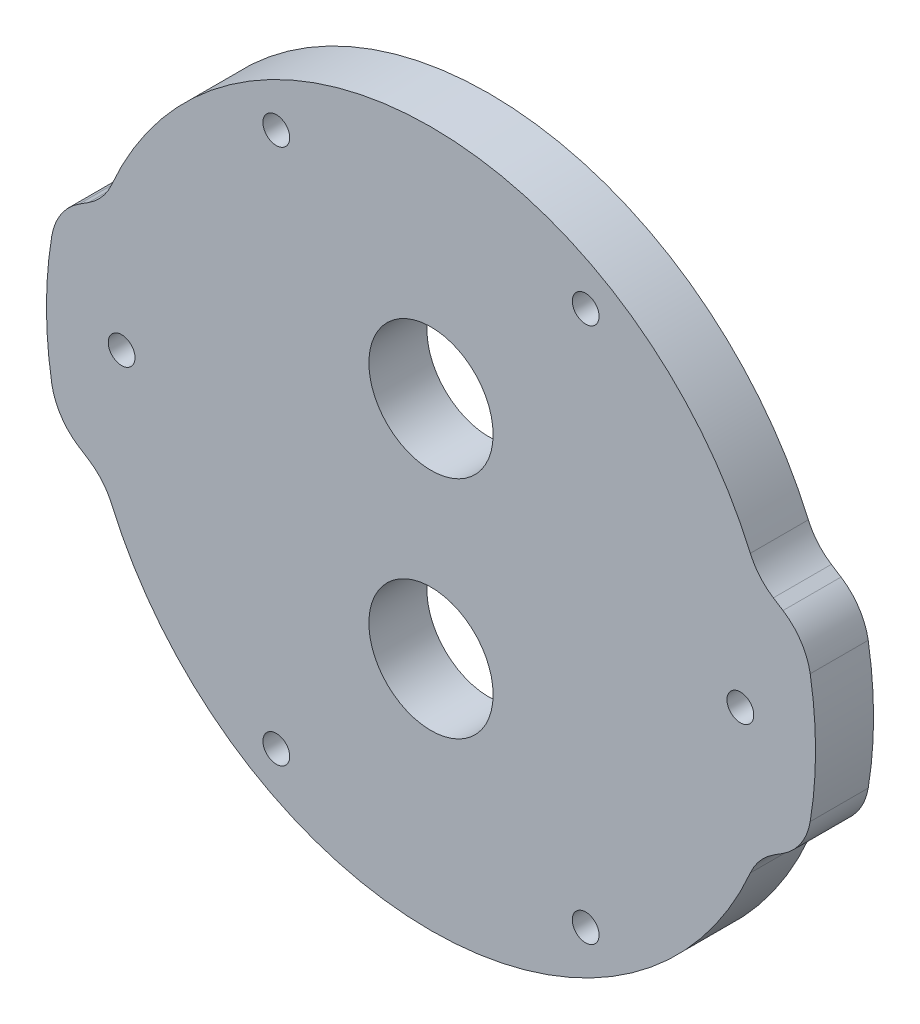
ISO-10303-21;
HEADER;
FILE_DESCRIPTION(('STEP AP214'),'2;1');
FILE_NAME('part.step','',(''),(''),'','','');
FILE_SCHEMA(('AUTOMOTIVE_DESIGN { 1 0 10303 214 1 1 1 1 }'));
ENDSEC;
DATA;
#1=APPLICATION_CONTEXT('core data for automotive mechanical design processes');
#2=APPLICATION_PROTOCOL_DEFINITION('international standard','automotive_design',2000,#1);
#3=PRODUCT_CONTEXT('',#1,'mechanical');
#4=PRODUCT('Part','Part','',(#3));
#5=PRODUCT_RELATED_PRODUCT_CATEGORY('part','',(#4));
#6=PRODUCT_DEFINITION_FORMATION('','',#4);
#7=PRODUCT_DEFINITION_CONTEXT('part definition',#1,'design');
#8=PRODUCT_DEFINITION('design','',#6,#7);
#9=PRODUCT_DEFINITION_SHAPE('','',#8);
#10=(LENGTH_UNIT() NAMED_UNIT(*) SI_UNIT(.MILLI.,.METRE.));
#11=(NAMED_UNIT(*) PLANE_ANGLE_UNIT() SI_UNIT($,.RADIAN.));
#12=(NAMED_UNIT(*) SI_UNIT($,.STERADIAN.) SOLID_ANGLE_UNIT());
#13=UNCERTAINTY_MEASURE_WITH_UNIT(LENGTH_MEASURE(1.E-05),#10,'distance_accuracy_value','');
#14=(GEOMETRIC_REPRESENTATION_CONTEXT(3) GLOBAL_UNCERTAINTY_ASSIGNED_CONTEXT((#13)) GLOBAL_UNIT_ASSIGNED_CONTEXT((#10,
#11,#12)) REPRESENTATION_CONTEXT('',''));
#15=CARTESIAN_POINT('',(0.,0.,0.));
#16=DIRECTION('',(0.,0.,1.));
#17=DIRECTION('',(1.,0.,0.));
#18=AXIS2_PLACEMENT_3D('',#15,#16,#17);
#19=CARTESIAN_POINT('',(0.,0.,4.7625));
#20=DIRECTION('',(0.,0.,-1.));
#21=DIRECTION('',(-1.,0.,0.));
#22=AXIS2_PLACEMENT_3D('',#19,#20,#21);
#23=PLANE('',#22);
#24=CARTESIAN_POINT('',(0.,9.25,4.7625));
#25=DIRECTION('',(0.,0.,1.));
#26=DIRECTION('',(1.,0.,0.));
#27=AXIS2_PLACEMENT_3D('',#24,#25,#26);
#28=CIRCLE('',#27,5.1);
#29=CARTESIAN_POINT('',(5.09999999999997,9.25,4.7625));
#30=VERTEX_POINT('',#29);
#31=EDGE_CURVE('E569',#30,#30,#28,.T.);
#32=ORIENTED_EDGE('',*,*,#31,.F.);
#33=EDGE_LOOP('',(#32));
#34=FACE_BOUND('',#33,.T.);
#35=CARTESIAN_POINT('',(0.,-9.25,4.7625));
#36=DIRECTION('',(0.,0.,1.));
#37=DIRECTION('',(1.,0.,0.));
#38=AXIS2_PLACEMENT_3D('',#35,#36,#37);
#39=CIRCLE('',#38,5.1);
#40=CARTESIAN_POINT('',(5.10000000000004,-9.25,4.7625));
#41=VERTEX_POINT('',#40);
#42=EDGE_CURVE('E571',#41,#41,#39,.T.);
#43=ORIENTED_EDGE('',*,*,#42,.F.);
#44=EDGE_LOOP('',(#43));
#45=FACE_BOUND('',#44,.T.);
#46=CARTESIAN_POINT('',(25.4000000000023,0.,4.7625));
#47=DIRECTION('',(0.,0.,1.));
#48=DIRECTION('',(1.,0.,0.));
#49=AXIS2_PLACEMENT_3D('',#46,#47,#48);
#50=CIRCLE('',#49,1.10000000000001);
#51=CARTESIAN_POINT('',(26.5000000000024,0.,4.7625));
#52=VERTEX_POINT('',#51);
#53=EDGE_CURVE('E586',#52,#52,#50,.T.);
#54=ORIENTED_EDGE('',*,*,#53,.F.);
#55=EDGE_LOOP('',(#54));
#56=FACE_BOUND('',#55,.T.);
#57=CARTESIAN_POINT('',(-12.7000000000012,21.9970452561268,4.7625));
#58=DIRECTION('',(0.,0.,1.));
#59=DIRECTION('',(1.,0.,0.));
#60=AXIS2_PLACEMENT_3D('',#57,#58,#59);
#61=CIRCLE('',#60,1.1);
#62=CARTESIAN_POINT('',(-11.6000000000012,21.9970452561268,4.7625));
#63=VERTEX_POINT('',#62);
#64=EDGE_CURVE('E598',#63,#63,#61,.T.);
#65=ORIENTED_EDGE('',*,*,#64,.F.);
#66=EDGE_LOOP('',(#65));
#67=FACE_BOUND('',#66,.T.);
#68=CARTESIAN_POINT('',(-25.4000000000023,0.,4.7625));
#69=DIRECTION('',(0.,0.,1.));
#70=DIRECTION('',(1.,0.,0.));
#71=AXIS2_PLACEMENT_3D('',#68,#69,#70);
#72=CIRCLE('',#71,1.1);
#73=CARTESIAN_POINT('',(-24.3000000000023,0.,4.7625));
#74=VERTEX_POINT('',#73);
#75=EDGE_CURVE('E306',#74,#74,#72,.T.);
#76=ORIENTED_EDGE('',*,*,#75,.F.);
#77=EDGE_LOOP('',(#76));
#78=FACE_BOUND('',#77,.T.);
#79=CARTESIAN_POINT('',(0.,0.,4.7625));
#80=DIRECTION('',(0.,0.,1.));
#81=DIRECTION('',(-1.,0.,0.));
#82=AXIS2_PLACEMENT_3D('',#79,#80,#81);
#83=CIRCLE('',#82,31.575);
#84=CARTESIAN_POINT('',(31.1345138238998,-5.25572772785986,4.7625));
#85=VERTEX_POINT('',#84);
#86=CARTESIAN_POINT('',(31.1345138238998,5.25572772785986,4.7625));
#87=VERTEX_POINT('',#86);
#88=EDGE_CURVE('E195',#85,#87,#83,.T.);
#89=ORIENTED_EDGE('',*,*,#88,.T.);
#90=CARTESIAN_POINT('',(26.2042661874944,4.42346680500003,4.7625));
#91=DIRECTION('',(0.,0.,-1.));
#92=DIRECTION('',(-1.,0.,0.));
#93=AXIS2_PLACEMENT_3D('',#90,#91,#92);
#94=CIRCLE('',#93,5.);
#95=CARTESIAN_POINT('',(28.9010073987016,8.63388089862277,4.7625));
#96=VERTEX_POINT('',#95);
#97=EDGE_CURVE('E220',#87,#96,#94,.F.);
#98=ORIENTED_EDGE('',*,*,#97,.T.);
#99=DIRECTION('',(-0.842082818724548,0.53934824224143,0.));
#100=VECTOR('',#99,1.);
#101=CARTESIAN_POINT('',(30.6713322990704,7.50000000000001,4.7625));
#102=LINE('',#101,#100);
#103=CARTESIAN_POINT('',(28.1095056204985,9.14083233298568,4.7625));
#104=VERTEX_POINT('',#103);
#105=EDGE_CURVE('E297',#96,#104,#102,.T.);
#106=ORIENTED_EDGE('',*,*,#105,.T.);
#107=CARTESIAN_POINT('',(30.8062468317057,13.3512464266084,4.7625));
#108=DIRECTION('',(0.,0.,-1.));
#109=DIRECTION('',(-1.,0.,0.));
#110=AXIS2_PLACEMENT_3D('',#107,#108,#109);
#111=CIRCLE('',#110,5.);
#112=CARTESIAN_POINT('',(26.2185704606401,11.3629744345595,4.7625));
#113=VERTEX_POINT('',#112);
#114=EDGE_CURVE('E158',#104,#113,#111,.T.);
#115=ORIENTED_EDGE('',*,*,#114,.T.);
#116=CARTESIAN_POINT('',(0.,0.,4.7625));
#117=DIRECTION('',(0.,0.,1.));
#118=DIRECTION('',(1.,0.,0.));
#119=AXIS2_PLACEMENT_3D('',#116,#117,#118);
#120=CIRCLE('',#119,28.575);
#121=CARTESIAN_POINT('',(-26.2185704606401,11.3629744345595,4.7625));
#122=VERTEX_POINT('',#121);
#123=EDGE_CURVE('E168',#113,#122,#120,.T.);
#124=ORIENTED_EDGE('',*,*,#123,.T.);
#125=CARTESIAN_POINT('',(-30.8062468317057,13.3512464266084,4.7625));
#126=DIRECTION('',(0.,0.,-1.));
#127=DIRECTION('',(-1.,0.,0.));
#128=AXIS2_PLACEMENT_3D('',#125,#126,#127);
#129=CIRCLE('',#128,5.);
#130=CARTESIAN_POINT('',(-28.1095056204985,9.14083233298567,4.7625));
#131=VERTEX_POINT('',#130);
#132=EDGE_CURVE('E11',#122,#131,#129,.T.);
#133=ORIENTED_EDGE('',*,*,#132,.T.);
#134=DIRECTION('',(-0.842082818724547,-0.539348242241431,0.));
#135=VECTOR('',#134,1.);
#136=CARTESIAN_POINT('',(-30.6713322990704,7.5,4.7625));
#137=LINE('',#136,#135);
#138=CARTESIAN_POINT('',(-28.9010073987016,8.63388089862276,4.7625));
#139=VERTEX_POINT('',#138);
#140=EDGE_CURVE('E292',#131,#139,#137,.T.);
#141=ORIENTED_EDGE('',*,*,#140,.T.);
#142=CARTESIAN_POINT('',(-26.2042661874944,4.42346680500002,4.7625));
#143=DIRECTION('',(0.,0.,-1.));
#144=DIRECTION('',(-1.,0.,0.));
#145=AXIS2_PLACEMENT_3D('',#142,#143,#144);
#146=CIRCLE('',#145,5.);
#147=CARTESIAN_POINT('',(-31.1345138238998,5.25572772785986,4.7625));
#148=VERTEX_POINT('',#147);
#149=EDGE_CURVE('E214',#139,#148,#146,.F.);
#150=ORIENTED_EDGE('',*,*,#149,.T.);
#151=CARTESIAN_POINT('',(0.,0.,4.7625));
#152=DIRECTION('',(0.,0.,1.));
#153=DIRECTION('',(1.,0.,0.));
#154=AXIS2_PLACEMENT_3D('',#151,#152,#153);
#155=CIRCLE('',#154,31.575);
#156=CARTESIAN_POINT('',(-31.1345138238998,-5.25572772785986,4.7625));
#157=VERTEX_POINT('',#156);
#158=EDGE_CURVE('E283',#148,#157,#155,.T.);
#159=ORIENTED_EDGE('',*,*,#158,.T.);
#160=CARTESIAN_POINT('',(-26.2042661874944,-4.42346680500002,4.7625));
#161=DIRECTION('',(0.,0.,-1.));
#162=DIRECTION('',(-1.,0.,0.));
#163=AXIS2_PLACEMENT_3D('',#160,#161,#162);
#164=CIRCLE('',#163,5.);
#165=CARTESIAN_POINT('',(-28.9010073987016,-8.63388089862276,4.7625));
#166=VERTEX_POINT('',#165);
#167=EDGE_CURVE('E216',#157,#166,#164,.F.);
#168=ORIENTED_EDGE('',*,*,#167,.T.);
#169=DIRECTION('',(0.842082818724547,-0.539348242241431,0.));
#170=VECTOR('',#169,1.);
#171=CARTESIAN_POINT('',(-30.6713322990704,-7.5,4.7625));
#172=LINE('',#171,#170);
#173=CARTESIAN_POINT('',(-28.1095056204985,-9.14083233298567,4.7625));
#174=VERTEX_POINT('',#173);
#175=EDGE_CURVE('E259',#166,#174,#172,.T.);
#176=ORIENTED_EDGE('',*,*,#175,.T.);
#177=CARTESIAN_POINT('',(-30.8062468317057,-13.3512464266084,4.7625));
#178=DIRECTION('',(0.,0.,-1.));
#179=DIRECTION('',(-1.,0.,0.));
#180=AXIS2_PLACEMENT_3D('',#177,#178,#179);
#181=CIRCLE('',#180,5.);
#182=CARTESIAN_POINT('',(-26.2185704606401,-11.3629744345595,4.7625));
#183=VERTEX_POINT('',#182);
#184=EDGE_CURVE('E251',#174,#183,#181,.T.);
#185=ORIENTED_EDGE('',*,*,#184,.T.);
#186=CARTESIAN_POINT('',(0.,0.,4.7625));
#187=DIRECTION('',(0.,0.,1.));
#188=DIRECTION('',(1.,0.,0.));
#189=AXIS2_PLACEMENT_3D('',#186,#187,#188);
#190=CIRCLE('',#189,28.575);
#191=CARTESIAN_POINT('',(26.2185704606401,-11.3629744345595,4.7625));
#192=VERTEX_POINT('',#191);
#193=EDGE_CURVE('E257',#183,#192,#190,.T.);
#194=ORIENTED_EDGE('',*,*,#193,.T.);
#195=CARTESIAN_POINT('',(30.8062468317057,-13.3512464266084,4.7625));
#196=DIRECTION('',(0.,0.,-1.));
#197=DIRECTION('',(-1.,0.,0.));
#198=AXIS2_PLACEMENT_3D('',#195,#196,#197);
#199=CIRCLE('',#198,5.);
#200=CARTESIAN_POINT('',(28.1095056204985,-9.14083233298568,4.7625));
#201=VERTEX_POINT('',#200);
#202=EDGE_CURVE('E56',#192,#201,#199,.T.);
#203=ORIENTED_EDGE('',*,*,#202,.T.);
#204=DIRECTION('',(0.842082818724548,0.53934824224143,0.));
#205=VECTOR('',#204,1.);
#206=CARTESIAN_POINT('',(30.6713322990704,-7.50000000000001,4.7625));
#207=LINE('',#206,#205);
#208=CARTESIAN_POINT('',(28.9010073987016,-8.63388089862277,4.7625));
#209=VERTEX_POINT('',#208);
#210=EDGE_CURVE('E196',#201,#209,#207,.T.);
#211=ORIENTED_EDGE('',*,*,#210,.T.);
#212=CARTESIAN_POINT('',(26.2042661874944,-4.42346680500003,4.7625));
#213=DIRECTION('',(0.,0.,-1.));
#214=DIRECTION('',(-1.,0.,0.));
#215=AXIS2_PLACEMENT_3D('',#212,#213,#214);
#216=CIRCLE('',#215,5.);
#217=EDGE_CURVE('E218',#209,#85,#216,.F.);
#218=ORIENTED_EDGE('',*,*,#217,.T.);
#219=EDGE_LOOP('',(#89,#98,#106,#115,#124,#133,#141,#150,#159,#168,#176,#185,#194,#203,#211,#218));
#220=FACE_BOUND('',#219,.T.);
#221=CARTESIAN_POINT('',(12.7000000000012,-21.9970452561268,4.7625));
#222=DIRECTION('',(0.,0.,1.));
#223=DIRECTION('',(1.,0.,0.));
#224=AXIS2_PLACEMENT_3D('',#221,#222,#223);
#225=CIRCLE('',#224,1.1);
#226=CARTESIAN_POINT('',(13.8000000000012,-21.9970452561268,4.7625));
#227=VERTEX_POINT('',#226);
#228=EDGE_CURVE('E316',#227,#227,#225,.T.);
#229=ORIENTED_EDGE('',*,*,#228,.F.);
#230=EDGE_LOOP('',(#229));
#231=FACE_BOUND('',#230,.T.);
#232=CARTESIAN_POINT('',(12.7000000000012,21.9970452561268,4.7625));
#233=DIRECTION('',(0.,0.,1.));
#234=DIRECTION('',(1.,0.,0.));
#235=AXIS2_PLACEMENT_3D('',#232,#233,#234);
#236=CIRCLE('',#235,1.1);
#237=CARTESIAN_POINT('',(13.8000000000012,21.9970452561268,4.7625));
#238=VERTEX_POINT('',#237);
#239=EDGE_CURVE('E592',#238,#238,#236,.T.);
#240=ORIENTED_EDGE('',*,*,#239,.F.);
#241=EDGE_LOOP('',(#240));
#242=FACE_BOUND('',#241,.T.);
#243=CARTESIAN_POINT('',(-12.7000000000012,-21.9970452561268,4.7625));
#244=DIRECTION('',(0.,0.,1.));
#245=DIRECTION('',(1.,0.,0.));
#246=AXIS2_PLACEMENT_3D('',#243,#244,#245);
#247=CIRCLE('',#246,1.1);
#248=CARTESIAN_POINT('',(-11.6000000000012,-21.9970452561268,4.7625));
#249=VERTEX_POINT('',#248);
#250=EDGE_CURVE('E580',#249,#249,#247,.T.);
#251=ORIENTED_EDGE('',*,*,#250,.F.);
#252=EDGE_LOOP('',(#251));
#253=FACE_BOUND('',#252,.T.);
#254=ADVANCED_FACE('F34',(#34,#45,#56,#67,#78,#220,#231,#242,#253),#23,.F.);
#255=CARTESIAN_POINT('',(0.,0.,0.));
#256=DIRECTION('',(0.,0.,-1.));
#257=DIRECTION('',(-1.,0.,0.));
#258=AXIS2_PLACEMENT_3D('',#255,#256,#257);
#259=PLANE('',#258);
#260=CARTESIAN_POINT('',(0.,9.25,0.));
#261=DIRECTION('',(0.,0.,1.));
#262=DIRECTION('',(1.,0.,0.));
#263=AXIS2_PLACEMENT_3D('',#260,#261,#262);
#264=CIRCLE('',#263,5.1);
#265=CARTESIAN_POINT('',(5.09999999999997,9.25,0.));
#266=VERTEX_POINT('',#265);
#267=EDGE_CURVE('E567',#266,#266,#264,.T.);
#268=ORIENTED_EDGE('',*,*,#267,.T.);
#269=EDGE_LOOP('',(#268));
#270=FACE_BOUND('',#269,.T.);
#271=CARTESIAN_POINT('',(0.,-9.25,0.));
#272=DIRECTION('',(0.,0.,1.));
#273=DIRECTION('',(1.,0.,0.));
#274=AXIS2_PLACEMENT_3D('',#271,#272,#273);
#275=CIRCLE('',#274,5.1);
#276=CARTESIAN_POINT('',(5.10000000000004,-9.25,0.));
#277=VERTEX_POINT('',#276);
#278=EDGE_CURVE('E574',#277,#277,#275,.T.);
#279=ORIENTED_EDGE('',*,*,#278,.T.);
#280=EDGE_LOOP('',(#279));
#281=FACE_BOUND('',#280,.T.);
#282=CARTESIAN_POINT('',(25.4000000000023,0.,0.));
#283=DIRECTION('',(0.,0.,1.));
#284=DIRECTION('',(1.,0.,0.));
#285=AXIS2_PLACEMENT_3D('',#282,#283,#284);
#286=CIRCLE('',#285,1.10000000000001);
#287=CARTESIAN_POINT('',(26.5000000000024,0.,0.));
#288=VERTEX_POINT('',#287);
#289=EDGE_CURVE('E583',#288,#288,#286,.T.);
#290=ORIENTED_EDGE('',*,*,#289,.T.);
#291=EDGE_LOOP('',(#290));
#292=FACE_BOUND('',#291,.T.);
#293=CARTESIAN_POINT('',(-12.7000000000012,21.9970452561268,0.));
#294=DIRECTION('',(0.,0.,1.));
#295=DIRECTION('',(1.,0.,0.));
#296=AXIS2_PLACEMENT_3D('',#293,#294,#295);
#297=CIRCLE('',#296,1.1);
#298=CARTESIAN_POINT('',(-11.6000000000012,21.9970452561268,0.));
#299=VERTEX_POINT('',#298);
#300=EDGE_CURVE('E595',#299,#299,#297,.T.);
#301=ORIENTED_EDGE('',*,*,#300,.T.);
#302=EDGE_LOOP('',(#301));
#303=FACE_BOUND('',#302,.T.);
#304=CARTESIAN_POINT('',(-25.4000000000023,0.,0.));
#305=DIRECTION('',(0.,0.,1.));
#306=DIRECTION('',(1.,0.,0.));
#307=AXIS2_PLACEMENT_3D('',#304,#305,#306);
#308=CIRCLE('',#307,1.1);
#309=CARTESIAN_POINT('',(-24.3000000000023,0.,0.));
#310=VERTEX_POINT('',#309);
#311=EDGE_CURVE('E311',#310,#310,#308,.T.);
#312=ORIENTED_EDGE('',*,*,#311,.T.);
#313=EDGE_LOOP('',(#312));
#314=FACE_BOUND('',#313,.T.);
#315=DIRECTION('',(-0.842082818724548,0.53934824224143,0.));
#316=VECTOR('',#315,1.);
#317=CARTESIAN_POINT('',(30.6713322990704,7.50000000000001,0.));
#318=LINE('',#317,#316);
#319=CARTESIAN_POINT('',(28.9010073987016,8.63388089862277,0.));
#320=VERTEX_POINT('',#319);
#321=CARTESIAN_POINT('',(28.1095056204985,9.14083233298568,0.));
#322=VERTEX_POINT('',#321);
#323=EDGE_CURVE('E176',#320,#322,#318,.T.);
#324=ORIENTED_EDGE('',*,*,#323,.F.);
#325=CARTESIAN_POINT('',(26.2042661874944,4.42346680500003,0.));
#326=DIRECTION('',(0.,0.,-1.));
#327=DIRECTION('',(-1.,0.,0.));
#328=AXIS2_PLACEMENT_3D('',#325,#326,#327);
#329=CIRCLE('',#328,5.);
#330=CARTESIAN_POINT('',(31.1345138238998,5.25572772785986,0.));
#331=VERTEX_POINT('',#330);
#332=EDGE_CURVE('E207',#320,#331,#329,.T.);
#333=ORIENTED_EDGE('',*,*,#332,.T.);
#334=CARTESIAN_POINT('',(0.,0.,0.));
#335=DIRECTION('',(0.,0.,1.));
#336=DIRECTION('',(-1.,0.,0.));
#337=AXIS2_PLACEMENT_3D('',#334,#335,#336);
#338=CIRCLE('',#337,31.575);
#339=CARTESIAN_POINT('',(31.1345138238998,-5.25572772785986,0.));
#340=VERTEX_POINT('',#339);
#341=EDGE_CURVE('E181',#340,#331,#338,.T.);
#342=ORIENTED_EDGE('',*,*,#341,.F.);
#343=CARTESIAN_POINT('',(26.2042661874944,-4.42346680500003,0.));
#344=DIRECTION('',(0.,0.,-1.));
#345=DIRECTION('',(-1.,0.,0.));
#346=AXIS2_PLACEMENT_3D('',#343,#344,#345);
#347=CIRCLE('',#346,5.);
#348=CARTESIAN_POINT('',(28.9010073987016,-8.63388089862277,0.));
#349=VERTEX_POINT('',#348);
#350=EDGE_CURVE('E205',#340,#349,#347,.T.);
#351=ORIENTED_EDGE('',*,*,#350,.T.);
#352=DIRECTION('',(0.842082818724548,0.53934824224143,0.));
#353=VECTOR('',#352,1.);
#354=CARTESIAN_POINT('',(30.6713322990704,-7.50000000000001,0.));
#355=LINE('',#354,#353);
#356=CARTESIAN_POINT('',(28.1095056204985,-9.14083233298568,0.));
#357=VERTEX_POINT('',#356);
#358=EDGE_CURVE('E193',#357,#349,#355,.T.);
#359=ORIENTED_EDGE('',*,*,#358,.F.);
#360=CARTESIAN_POINT('',(30.8062468317057,-13.3512464266084,0.));
#361=DIRECTION('',(0.,0.,-1.));
#362=DIRECTION('',(-1.,0.,0.));
#363=AXIS2_PLACEMENT_3D('',#360,#361,#362);
#364=CIRCLE('',#363,5.);
#365=CARTESIAN_POINT('',(26.2185704606401,-11.3629744345595,0.));
#366=VERTEX_POINT('',#365);
#367=EDGE_CURVE('E246',#357,#366,#364,.F.);
#368=ORIENTED_EDGE('',*,*,#367,.T.);
#369=CARTESIAN_POINT('',(0.,0.,0.));
#370=DIRECTION('',(0.,0.,1.));
#371=DIRECTION('',(1.,0.,0.));
#372=AXIS2_PLACEMENT_3D('',#369,#370,#371);
#373=CIRCLE('',#372,28.575);
#374=CARTESIAN_POINT('',(-26.2185704606401,-11.3629744345595,0.));
#375=VERTEX_POINT('',#374);
#376=EDGE_CURVE('E190',#375,#366,#373,.T.);
#377=ORIENTED_EDGE('',*,*,#376,.F.);
#378=CARTESIAN_POINT('',(-30.8062468317057,-13.3512464266084,0.));
#379=DIRECTION('',(0.,0.,-1.));
#380=DIRECTION('',(-1.,0.,0.));
#381=AXIS2_PLACEMENT_3D('',#378,#379,#380);
#382=CIRCLE('',#381,5.);
#383=CARTESIAN_POINT('',(-28.1095056204985,-9.14083233298567,0.));
#384=VERTEX_POINT('',#383);
#385=EDGE_CURVE('E249',#375,#384,#382,.F.);
#386=ORIENTED_EDGE('',*,*,#385,.T.);
#387=DIRECTION('',(0.842082818724547,-0.539348242241431,0.));
#388=VECTOR('',#387,1.);
#389=CARTESIAN_POINT('',(-30.6713322990704,-7.5,0.));
#390=LINE('',#389,#388);
#391=CARTESIAN_POINT('',(-28.9010073987016,-8.63388089862276,0.));
#392=VERTEX_POINT('',#391);
#393=EDGE_CURVE('E187',#392,#384,#390,.T.);
#394=ORIENTED_EDGE('',*,*,#393,.F.);
#395=CARTESIAN_POINT('',(-26.2042661874944,-4.42346680500002,0.));
#396=DIRECTION('',(0.,0.,-1.));
#397=DIRECTION('',(-1.,0.,0.));
#398=AXIS2_PLACEMENT_3D('',#395,#396,#397);
#399=CIRCLE('',#398,5.);
#400=CARTESIAN_POINT('',(-31.1345138238998,-5.25572772785986,0.));
#401=VERTEX_POINT('',#400);
#402=EDGE_CURVE('E203',#392,#401,#399,.T.);
#403=ORIENTED_EDGE('',*,*,#402,.T.);
#404=CARTESIAN_POINT('',(0.,0.,0.));
#405=DIRECTION('',(0.,0.,1.));
#406=DIRECTION('',(1.,0.,0.));
#407=AXIS2_PLACEMENT_3D('',#404,#405,#406);
#408=CIRCLE('',#407,31.575);
#409=CARTESIAN_POINT('',(-31.1345138238998,5.25572772785986,0.));
#410=VERTEX_POINT('',#409);
#411=EDGE_CURVE('E179',#410,#401,#408,.T.);
#412=ORIENTED_EDGE('',*,*,#411,.F.);
#413=CARTESIAN_POINT('',(-26.2042661874944,4.42346680500002,0.));
#414=DIRECTION('',(0.,0.,-1.));
#415=DIRECTION('',(-1.,0.,0.));
#416=AXIS2_PLACEMENT_3D('',#413,#414,#415);
#417=CIRCLE('',#416,5.);
#418=CARTESIAN_POINT('',(-28.9010073987016,8.63388089862276,0.));
#419=VERTEX_POINT('',#418);
#420=EDGE_CURVE('E201',#410,#419,#417,.T.);
#421=ORIENTED_EDGE('',*,*,#420,.T.);
#422=DIRECTION('',(-0.842082818724547,-0.539348242241431,0.));
#423=VECTOR('',#422,1.);
#424=CARTESIAN_POINT('',(-30.6713322990704,7.5,0.));
#425=LINE('',#424,#423);
#426=CARTESIAN_POINT('',(-28.1095056204985,9.14083233298567,0.));
#427=VERTEX_POINT('',#426);
#428=EDGE_CURVE('E175',#427,#419,#425,.T.);
#429=ORIENTED_EDGE('',*,*,#428,.F.);
#430=CARTESIAN_POINT('',(-30.8062468317057,13.3512464266084,0.));
#431=DIRECTION('',(0.,0.,-1.));
#432=DIRECTION('',(-1.,0.,0.));
#433=AXIS2_PLACEMENT_3D('',#430,#431,#432);
#434=CIRCLE('',#433,5.);
#435=CARTESIAN_POINT('',(-26.2185704606401,11.3629744345595,0.));
#436=VERTEX_POINT('',#435);
#437=EDGE_CURVE('E42',#427,#436,#434,.F.);
#438=ORIENTED_EDGE('',*,*,#437,.T.);
#439=CARTESIAN_POINT('',(0.,0.,0.));
#440=DIRECTION('',(0.,0.,1.));
#441=DIRECTION('',(1.,0.,0.));
#442=AXIS2_PLACEMENT_3D('',#439,#440,#441);
#443=CIRCLE('',#442,28.575);
#444=CARTESIAN_POINT('',(26.2185704606401,11.3629744345595,0.));
#445=VERTEX_POINT('',#444);
#446=EDGE_CURVE('E165',#445,#436,#443,.T.);
#447=ORIENTED_EDGE('',*,*,#446,.F.);
#448=CARTESIAN_POINT('',(30.8062468317057,13.3512464266084,0.));
#449=DIRECTION('',(0.,0.,-1.));
#450=DIRECTION('',(-1.,0.,0.));
#451=AXIS2_PLACEMENT_3D('',#448,#449,#450);
#452=CIRCLE('',#451,5.);
#453=EDGE_CURVE('E148',#445,#322,#452,.F.);
#454=ORIENTED_EDGE('',*,*,#453,.T.);
#455=EDGE_LOOP('',(#324,#333,#342,#351,#359,#368,#377,#386,#394,#403,#412,#421,#429,#438,#447,#454));
#456=FACE_BOUND('',#455,.T.);
#457=CARTESIAN_POINT('',(12.7000000000012,-21.9970452561268,0.));
#458=DIRECTION('',(0.,0.,1.));
#459=DIRECTION('',(1.,0.,0.));
#460=AXIS2_PLACEMENT_3D('',#457,#458,#459);
#461=CIRCLE('',#460,1.1);
#462=CARTESIAN_POINT('',(13.8000000000012,-21.9970452561268,0.));
#463=VERTEX_POINT('',#462);
#464=EDGE_CURVE('E319',#463,#463,#461,.T.);
#465=ORIENTED_EDGE('',*,*,#464,.T.);
#466=EDGE_LOOP('',(#465));
#467=FACE_BOUND('',#466,.T.);
#468=CARTESIAN_POINT('',(12.7000000000012,21.9970452561268,0.));
#469=DIRECTION('',(0.,0.,1.));
#470=DIRECTION('',(1.,0.,0.));
#471=AXIS2_PLACEMENT_3D('',#468,#469,#470);
#472=CIRCLE('',#471,1.1);
#473=CARTESIAN_POINT('',(13.8000000000012,21.9970452561268,0.));
#474=VERTEX_POINT('',#473);
#475=EDGE_CURVE('E589',#474,#474,#472,.T.);
#476=ORIENTED_EDGE('',*,*,#475,.T.);
#477=EDGE_LOOP('',(#476));
#478=FACE_BOUND('',#477,.T.);
#479=CARTESIAN_POINT('',(-12.7000000000012,-21.9970452561268,0.));
#480=DIRECTION('',(0.,0.,1.));
#481=DIRECTION('',(1.,0.,0.));
#482=AXIS2_PLACEMENT_3D('',#479,#480,#481);
#483=CIRCLE('',#482,1.1);
#484=CARTESIAN_POINT('',(-11.6000000000012,-21.9970452561268,0.));
#485=VERTEX_POINT('',#484);
#486=EDGE_CURVE('E577',#485,#485,#483,.T.);
#487=ORIENTED_EDGE('',*,*,#486,.T.);
#488=EDGE_LOOP('',(#487));
#489=FACE_BOUND('',#488,.T.);
#490=ADVANCED_FACE('F172',(#270,#281,#292,#303,#314,#456,#467,#478,#489),#259,.T.);
#491=CARTESIAN_POINT('',(0.,0.,4.7625));
#492=DIRECTION('',(0.,0.,-1.));
#493=DIRECTION('',(-1.,0.,0.));
#494=AXIS2_PLACEMENT_3D('',#491,#492,#493);
#495=CYLINDRICAL_SURFACE('',#494,31.575);
#496=ORIENTED_EDGE('',*,*,#341,.T.);
#497=DIRECTION('',(0.,0.,-1.));
#498=VECTOR('',#497,1.);
#499=CARTESIAN_POINT('',(31.1345138238998,5.25572772785986,4.7625));
#500=LINE('',#499,#498);
#501=EDGE_CURVE('E212',#331,#87,#500,.F.);
#502=ORIENTED_EDGE('',*,*,#501,.T.);
#503=ORIENTED_EDGE('',*,*,#88,.F.);
#504=DIRECTION('',(0.,0.,-1.));
#505=VECTOR('',#504,1.);
#506=CARTESIAN_POINT('',(31.1345138238998,-5.25572772785986,4.7625));
#507=LINE('',#506,#505);
#508=EDGE_CURVE('E209',#85,#340,#507,.T.);
#509=ORIENTED_EDGE('',*,*,#508,.T.);
#510=EDGE_LOOP('',(#496,#502,#503,#509));
#511=FACE_BOUND('',#510,.T.);
#512=ADVANCED_FACE('F336',(#511),#495,.T.);
#513=CARTESIAN_POINT('',(30.6713322990704,7.50000000000001,4.7625));
#514=DIRECTION('',(-0.53934824224143,-0.842082818724548,0.));
#515=DIRECTION('',(0.842082818724548,-0.53934824224143,0.));
#516=AXIS2_PLACEMENT_3D('',#513,#514,#515);
#517=PLANE('',#516);
#518=ORIENTED_EDGE('',*,*,#323,.T.);
#519=DIRECTION('',(0.,0.,1.));
#520=VECTOR('',#519,1.);
#521=CARTESIAN_POINT('',(28.1095056204985,9.14083233298568,4.7625));
#522=LINE('',#521,#520);
#523=EDGE_CURVE('E153',#322,#104,#522,.T.);
#524=ORIENTED_EDGE('',*,*,#523,.T.);
#525=ORIENTED_EDGE('',*,*,#105,.F.);
#526=DIRECTION('',(0.,0.,-1.));
#527=VECTOR('',#526,1.);
#528=CARTESIAN_POINT('',(28.9010073987016,8.63388089862277,4.7625));
#529=LINE('',#528,#527);
#530=EDGE_CURVE('E169',#96,#320,#529,.T.);
#531=ORIENTED_EDGE('',*,*,#530,.T.);
#532=EDGE_LOOP('',(#518,#524,#525,#531));
#533=FACE_BOUND('',#532,.T.);
#534=ADVANCED_FACE('F330',(#533),#517,.F.);
#535=CARTESIAN_POINT('',(0.,0.,4.7625));
#536=DIRECTION('',(0.,0.,-1.));
#537=DIRECTION('',(-1.,0.,0.));
#538=AXIS2_PLACEMENT_3D('',#535,#536,#537);
#539=CYLINDRICAL_SURFACE('',#538,28.575);
#540=ORIENTED_EDGE('',*,*,#123,.F.);
#541=DIRECTION('',(0.,0.,-1.));
#542=VECTOR('',#541,1.);
#543=CARTESIAN_POINT('',(26.2185704606401,11.3629744345595,4.7625));
#544=LINE('',#543,#542);
#545=EDGE_CURVE('E152',#113,#445,#544,.T.);
#546=ORIENTED_EDGE('',*,*,#545,.T.);
#547=ORIENTED_EDGE('',*,*,#446,.T.);
#548=DIRECTION('',(0.,0.,-1.));
#549=VECTOR('',#548,1.);
#550=CARTESIAN_POINT('',(-26.2185704606401,11.3629744345595,4.7625));
#551=LINE('',#550,#549);
#552=EDGE_CURVE('E170',#436,#122,#551,.F.);
#553=ORIENTED_EDGE('',*,*,#552,.T.);
#554=EDGE_LOOP('',(#540,#546,#547,#553));
#555=FACE_BOUND('',#554,.T.);
#556=ADVANCED_FACE('F164',(#555),#539,.T.);
#557=CARTESIAN_POINT('',(-30.6713322990704,7.5,4.7625));
#558=DIRECTION('',(0.539348242241431,-0.842082818724547,0.));
#559=DIRECTION('',(0.842082818724547,0.539348242241431,0.));
#560=AXIS2_PLACEMENT_3D('',#557,#558,#559);
#561=PLANE('',#560);
#562=ORIENTED_EDGE('',*,*,#140,.F.);
#563=DIRECTION('',(0.,0.,1.));
#564=VECTOR('',#563,1.);
#565=CARTESIAN_POINT('',(-28.1095056204985,9.14083233298567,0.));
#566=LINE('',#565,#564);
#567=EDGE_CURVE('E159',#131,#427,#566,.F.);
#568=ORIENTED_EDGE('',*,*,#567,.T.);
#569=ORIENTED_EDGE('',*,*,#428,.T.);
#570=DIRECTION('',(0.,0.,-1.));
#571=VECTOR('',#570,1.);
#572=CARTESIAN_POINT('',(-28.9010073987016,8.63388089862276,4.7625));
#573=LINE('',#572,#571);
#574=EDGE_CURVE('E241',#419,#139,#573,.F.);
#575=ORIENTED_EDGE('',*,*,#574,.T.);
#576=EDGE_LOOP('',(#562,#568,#569,#575));
#577=FACE_BOUND('',#576,.T.);
#578=ADVANCED_FACE('F289',(#577),#561,.F.);
#579=CARTESIAN_POINT('',(0.,0.,4.7625));
#580=DIRECTION('',(0.,0.,-1.));
#581=DIRECTION('',(-1.,0.,0.));
#582=AXIS2_PLACEMENT_3D('',#579,#580,#581);
#583=CYLINDRICAL_SURFACE('',#582,31.575);
#584=ORIENTED_EDGE('',*,*,#411,.T.);
#585=DIRECTION('',(0.,0.,-1.));
#586=VECTOR('',#585,1.);
#587=CARTESIAN_POINT('',(-31.1345138238998,-5.25572772785986,4.7625));
#588=LINE('',#587,#586);
#589=EDGE_CURVE('E239',#401,#157,#588,.F.);
#590=ORIENTED_EDGE('',*,*,#589,.T.);
#591=ORIENTED_EDGE('',*,*,#158,.F.);
#592=DIRECTION('',(0.,0.,-1.));
#593=VECTOR('',#592,1.);
#594=CARTESIAN_POINT('',(-31.1345138238998,5.25572772785986,4.7625));
#595=LINE('',#594,#593);
#596=EDGE_CURVE('E236',#148,#410,#595,.T.);
#597=ORIENTED_EDGE('',*,*,#596,.T.);
#598=EDGE_LOOP('',(#584,#590,#591,#597));
#599=FACE_BOUND('',#598,.T.);
#600=ADVANCED_FACE('F279',(#599),#583,.T.);
#601=CARTESIAN_POINT('',(-30.6713322990704,-7.5,4.7625));
#602=DIRECTION('',(0.539348242241431,0.842082818724547,0.));
#603=DIRECTION('',(-0.842082818724547,0.539348242241431,0.));
#604=AXIS2_PLACEMENT_3D('',#601,#602,#603);
#605=PLANE('',#604);
#606=ORIENTED_EDGE('',*,*,#393,.T.);
#607=DIRECTION('',(0.,0.,1.));
#608=VECTOR('',#607,1.);
#609=CARTESIAN_POINT('',(-28.1095056204985,-9.14083233298567,4.7625));
#610=LINE('',#609,#608);
#611=EDGE_CURVE('E234',#384,#174,#610,.T.);
#612=ORIENTED_EDGE('',*,*,#611,.T.);
#613=ORIENTED_EDGE('',*,*,#175,.F.);
#614=DIRECTION('',(0.,0.,-1.));
#615=VECTOR('',#614,1.);
#616=CARTESIAN_POINT('',(-28.9010073987016,-8.63388089862276,4.7625));
#617=LINE('',#616,#615);
#618=EDGE_CURVE('E231',#166,#392,#617,.T.);
#619=ORIENTED_EDGE('',*,*,#618,.T.);
#620=EDGE_LOOP('',(#606,#612,#613,#619));
#621=FACE_BOUND('',#620,.T.);
#622=ADVANCED_FACE('F271',(#621),#605,.F.);
#623=CARTESIAN_POINT('',(0.,0.,4.7625));
#624=DIRECTION('',(0.,0.,-1.));
#625=DIRECTION('',(-1.,0.,0.));
#626=AXIS2_PLACEMENT_3D('',#623,#624,#625);
#627=CYLINDRICAL_SURFACE('',#626,28.575);
#628=ORIENTED_EDGE('',*,*,#376,.T.);
#629=DIRECTION('',(0.,0.,-1.));
#630=VECTOR('',#629,1.);
#631=CARTESIAN_POINT('',(26.2185704606401,-11.3629744345595,4.7625));
#632=LINE('',#631,#630);
#633=EDGE_CURVE('E229',#366,#192,#632,.F.);
#634=ORIENTED_EDGE('',*,*,#633,.T.);
#635=ORIENTED_EDGE('',*,*,#193,.F.);
#636=DIRECTION('',(0.,0.,-1.));
#637=VECTOR('',#636,1.);
#638=CARTESIAN_POINT('',(-26.2185704606401,-11.3629744345595,4.7625));
#639=LINE('',#638,#637);
#640=EDGE_CURVE('E226',#183,#375,#639,.T.);
#641=ORIENTED_EDGE('',*,*,#640,.T.);
#642=EDGE_LOOP('',(#628,#634,#635,#641));
#643=FACE_BOUND('',#642,.T.);
#644=ADVANCED_FACE('F264',(#643),#627,.T.);
#645=CARTESIAN_POINT('',(30.6713322990704,-7.50000000000001,4.7625));
#646=DIRECTION('',(-0.53934824224143,0.842082818724548,0.));
#647=DIRECTION('',(-0.842082818724548,-0.53934824224143,0.));
#648=AXIS2_PLACEMENT_3D('',#645,#646,#647);
#649=PLANE('',#648);
#650=ORIENTED_EDGE('',*,*,#358,.T.);
#651=DIRECTION('',(0.,0.,-1.));
#652=VECTOR('',#651,1.);
#653=CARTESIAN_POINT('',(28.9010073987016,-8.63388089862277,4.7625));
#654=LINE('',#653,#652);
#655=EDGE_CURVE('E49',#349,#209,#654,.F.);
#656=ORIENTED_EDGE('',*,*,#655,.T.);
#657=ORIENTED_EDGE('',*,*,#210,.F.);
#658=DIRECTION('',(0.,0.,1.));
#659=VECTOR('',#658,1.);
#660=CARTESIAN_POINT('',(28.1095056204985,-9.14083233298568,0.));
#661=LINE('',#660,#659);
#662=EDGE_CURVE('E222',#201,#357,#661,.F.);
#663=ORIENTED_EDGE('',*,*,#662,.T.);
#664=EDGE_LOOP('',(#650,#656,#657,#663));
#665=FACE_BOUND('',#664,.T.);
#666=ADVANCED_FACE('F333',(#665),#649,.F.);
#667=CARTESIAN_POINT('',(-25.4000000000023,0.,4.7625));
#668=DIRECTION('',(0.,0.,-1.));
#669=DIRECTION('',(-1.,0.,0.));
#670=AXIS2_PLACEMENT_3D('',#667,#668,#669);
#671=CYLINDRICAL_SURFACE('',#670,1.1);
#672=ORIENTED_EDGE('',*,*,#75,.T.);
#673=EDGE_LOOP('',(#672));
#674=FACE_BOUND('',#673,.T.);
#675=ORIENTED_EDGE('',*,*,#311,.F.);
#676=EDGE_LOOP('',(#675));
#677=FACE_BOUND('',#676,.T.);
#678=ADVANCED_FACE('F355',(#674,#677),#671,.F.);
#679=CARTESIAN_POINT('',(12.7000000000012,-21.9970452561268,4.7625));
#680=DIRECTION('',(0.,0.,-1.));
#681=DIRECTION('',(-1.,0.,0.));
#682=AXIS2_PLACEMENT_3D('',#679,#680,#681);
#683=CYLINDRICAL_SURFACE('',#682,1.1);
#684=ORIENTED_EDGE('',*,*,#228,.T.);
#685=EDGE_LOOP('',(#684));
#686=FACE_BOUND('',#685,.T.);
#687=ORIENTED_EDGE('',*,*,#464,.F.);
#688=EDGE_LOOP('',(#687));
#689=FACE_BOUND('',#688,.T.);
#690=ADVANCED_FACE('F400',(#686,#689),#683,.F.);
#691=CARTESIAN_POINT('',(-12.7000000000012,21.9970452561268,4.7625));
#692=DIRECTION('',(0.,0.,-1.));
#693=DIRECTION('',(-1.,0.,0.));
#694=AXIS2_PLACEMENT_3D('',#691,#692,#693);
#695=CYLINDRICAL_SURFACE('',#694,1.1);
#696=ORIENTED_EDGE('',*,*,#64,.T.);
#697=EDGE_LOOP('',(#696));
#698=FACE_BOUND('',#697,.T.);
#699=ORIENTED_EDGE('',*,*,#300,.F.);
#700=EDGE_LOOP('',(#699));
#701=FACE_BOUND('',#700,.T.);
#702=ADVANCED_FACE('F406',(#698,#701),#695,.F.);
#703=CARTESIAN_POINT('',(12.7000000000012,21.9970452561268,4.7625));
#704=DIRECTION('',(0.,0.,-1.));
#705=DIRECTION('',(-1.,0.,0.));
#706=AXIS2_PLACEMENT_3D('',#703,#704,#705);
#707=CYLINDRICAL_SURFACE('',#706,1.1);
#708=ORIENTED_EDGE('',*,*,#239,.T.);
#709=EDGE_LOOP('',(#708));
#710=FACE_BOUND('',#709,.T.);
#711=ORIENTED_EDGE('',*,*,#475,.F.);
#712=EDGE_LOOP('',(#711));
#713=FACE_BOUND('',#712,.T.);
#714=ADVANCED_FACE('F413',(#710,#713),#707,.F.);
#715=CARTESIAN_POINT('',(25.4000000000023,0.,4.7625));
#716=DIRECTION('',(0.,0.,-1.));
#717=DIRECTION('',(-1.,0.,0.));
#718=AXIS2_PLACEMENT_3D('',#715,#716,#717);
#719=CYLINDRICAL_SURFACE('',#718,1.10000000000001);
#720=ORIENTED_EDGE('',*,*,#53,.T.);
#721=EDGE_LOOP('',(#720));
#722=FACE_BOUND('',#721,.T.);
#723=ORIENTED_EDGE('',*,*,#289,.F.);
#724=EDGE_LOOP('',(#723));
#725=FACE_BOUND('',#724,.T.);
#726=ADVANCED_FACE('F421',(#722,#725),#719,.F.);
#727=CARTESIAN_POINT('',(-12.7000000000012,-21.9970452561268,4.7625));
#728=DIRECTION('',(0.,0.,-1.));
#729=DIRECTION('',(-1.,0.,0.));
#730=AXIS2_PLACEMENT_3D('',#727,#728,#729);
#731=CYLINDRICAL_SURFACE('',#730,1.1);
#732=ORIENTED_EDGE('',*,*,#250,.T.);
#733=EDGE_LOOP('',(#732));
#734=FACE_BOUND('',#733,.T.);
#735=ORIENTED_EDGE('',*,*,#486,.F.);
#736=EDGE_LOOP('',(#735));
#737=FACE_BOUND('',#736,.T.);
#738=ADVANCED_FACE('F429',(#734,#737),#731,.F.);
#739=CARTESIAN_POINT('',(30.8062468317057,13.3512464266084,4.7625));
#740=DIRECTION('',(0.,0.,-1.));
#741=DIRECTION('',(-1.,0.,0.));
#742=AXIS2_PLACEMENT_3D('',#739,#740,#741);
#743=CYLINDRICAL_SURFACE('',#742,5.);
#744=ORIENTED_EDGE('',*,*,#114,.F.);
#745=ORIENTED_EDGE('',*,*,#523,.F.);
#746=ORIENTED_EDGE('',*,*,#453,.F.);
#747=ORIENTED_EDGE('',*,*,#545,.F.);
#748=EDGE_LOOP('',(#744,#745,#746,#747));
#749=FACE_BOUND('',#748,.T.);
#750=ADVANCED_FACE('F151',(#749),#743,.F.);
#751=CARTESIAN_POINT('',(26.2042661874944,4.42346680500003,4.7625));
#752=DIRECTION('',(0.,0.,-1.));
#753=DIRECTION('',(-1.,0.,0.));
#754=AXIS2_PLACEMENT_3D('',#751,#752,#753);
#755=CYLINDRICAL_SURFACE('',#754,5.);
#756=ORIENTED_EDGE('',*,*,#97,.F.);
#757=ORIENTED_EDGE('',*,*,#501,.F.);
#758=ORIENTED_EDGE('',*,*,#332,.F.);
#759=ORIENTED_EDGE('',*,*,#530,.F.);
#760=EDGE_LOOP('',(#756,#757,#758,#759));
#761=FACE_BOUND('',#760,.T.);
#762=ADVANCED_FACE('F328',(#761),#755,.T.);
#763=CARTESIAN_POINT('',(26.2042661874944,-4.42346680500003,4.7625));
#764=DIRECTION('',(0.,0.,-1.));
#765=DIRECTION('',(-1.,0.,0.));
#766=AXIS2_PLACEMENT_3D('',#763,#764,#765);
#767=CYLINDRICAL_SURFACE('',#766,5.);
#768=ORIENTED_EDGE('',*,*,#217,.F.);
#769=ORIENTED_EDGE('',*,*,#655,.F.);
#770=ORIENTED_EDGE('',*,*,#350,.F.);
#771=ORIENTED_EDGE('',*,*,#508,.F.);
#772=EDGE_LOOP('',(#768,#769,#770,#771));
#773=FACE_BOUND('',#772,.T.);
#774=ADVANCED_FACE('F335',(#773),#767,.T.);
#775=CARTESIAN_POINT('',(30.8062468317057,-13.3512464266084,4.7625));
#776=DIRECTION('',(0.,0.,-1.));
#777=DIRECTION('',(-1.,0.,0.));
#778=AXIS2_PLACEMENT_3D('',#775,#776,#777);
#779=CYLINDRICAL_SURFACE('',#778,5.);
#780=ORIENTED_EDGE('',*,*,#202,.F.);
#781=ORIENTED_EDGE('',*,*,#633,.F.);
#782=ORIENTED_EDGE('',*,*,#367,.F.);
#783=ORIENTED_EDGE('',*,*,#662,.F.);
#784=EDGE_LOOP('',(#780,#781,#782,#783));
#785=FACE_BOUND('',#784,.T.);
#786=ADVANCED_FACE('F454',(#785),#779,.F.);
#787=CARTESIAN_POINT('',(-30.8062468317057,-13.3512464266084,4.7625));
#788=DIRECTION('',(0.,0.,-1.));
#789=DIRECTION('',(-1.,0.,0.));
#790=AXIS2_PLACEMENT_3D('',#787,#788,#789);
#791=CYLINDRICAL_SURFACE('',#790,5.);
#792=ORIENTED_EDGE('',*,*,#184,.F.);
#793=ORIENTED_EDGE('',*,*,#611,.F.);
#794=ORIENTED_EDGE('',*,*,#385,.F.);
#795=ORIENTED_EDGE('',*,*,#640,.F.);
#796=EDGE_LOOP('',(#792,#793,#794,#795));
#797=FACE_BOUND('',#796,.T.);
#798=ADVANCED_FACE('F268',(#797),#791,.F.);
#799=CARTESIAN_POINT('',(-26.2042661874944,-4.42346680500002,4.7625));
#800=DIRECTION('',(0.,0.,-1.));
#801=DIRECTION('',(-1.,0.,0.));
#802=AXIS2_PLACEMENT_3D('',#799,#800,#801);
#803=CYLINDRICAL_SURFACE('',#802,5.);
#804=ORIENTED_EDGE('',*,*,#167,.F.);
#805=ORIENTED_EDGE('',*,*,#589,.F.);
#806=ORIENTED_EDGE('',*,*,#402,.F.);
#807=ORIENTED_EDGE('',*,*,#618,.F.);
#808=EDGE_LOOP('',(#804,#805,#806,#807));
#809=FACE_BOUND('',#808,.T.);
#810=ADVANCED_FACE('F275',(#809),#803,.T.);
#811=CARTESIAN_POINT('',(-30.8062468317057,13.3512464266084,4.7625));
#812=DIRECTION('',(0.,0.,-1.));
#813=DIRECTION('',(-1.,0.,0.));
#814=AXIS2_PLACEMENT_3D('',#811,#812,#813);
#815=CYLINDRICAL_SURFACE('',#814,5.);
#816=ORIENTED_EDGE('',*,*,#132,.F.);
#817=ORIENTED_EDGE('',*,*,#552,.F.);
#818=ORIENTED_EDGE('',*,*,#437,.F.);
#819=ORIENTED_EDGE('',*,*,#567,.F.);
#820=EDGE_LOOP('',(#816,#817,#818,#819));
#821=FACE_BOUND('',#820,.T.);
#822=ADVANCED_FACE('F295',(#821),#815,.F.);
#823=CARTESIAN_POINT('',(-26.2042661874944,4.42346680500002,4.7625));
#824=DIRECTION('',(0.,0.,-1.));
#825=DIRECTION('',(-1.,0.,0.));
#826=AXIS2_PLACEMENT_3D('',#823,#824,#825);
#827=CYLINDRICAL_SURFACE('',#826,5.);
#828=ORIENTED_EDGE('',*,*,#149,.F.);
#829=ORIENTED_EDGE('',*,*,#574,.F.);
#830=ORIENTED_EDGE('',*,*,#420,.F.);
#831=ORIENTED_EDGE('',*,*,#596,.F.);
#832=EDGE_LOOP('',(#828,#829,#830,#831));
#833=FACE_BOUND('',#832,.T.);
#834=ADVANCED_FACE('F36',(#833),#827,.T.);
#835=CARTESIAN_POINT('',(0.,-9.25,0.));
#836=DIRECTION('',(0.,0.,1.));
#837=DIRECTION('',(1.,0.,0.));
#838=AXIS2_PLACEMENT_3D('',#835,#836,#837);
#839=CYLINDRICAL_SURFACE('',#838,5.1);
#840=ORIENTED_EDGE('',*,*,#278,.F.);
#841=EDGE_LOOP('',(#840));
#842=FACE_BOUND('',#841,.T.);
#843=ORIENTED_EDGE('',*,*,#42,.T.);
#844=EDGE_LOOP('',(#843));
#845=FACE_BOUND('',#844,.T.);
#846=ADVANCED_FACE('F485',(#842,#845),#839,.F.);
#847=CARTESIAN_POINT('',(0.,9.25,0.));
#848=DIRECTION('',(0.,0.,1.));
#849=DIRECTION('',(1.,0.,0.));
#850=AXIS2_PLACEMENT_3D('',#847,#848,#849);
#851=CYLINDRICAL_SURFACE('',#850,5.1);
#852=ORIENTED_EDGE('',*,*,#267,.F.);
#853=EDGE_LOOP('',(#852));
#854=FACE_BOUND('',#853,.T.);
#855=ORIENTED_EDGE('',*,*,#31,.T.);
#856=EDGE_LOOP('',(#855));
#857=FACE_BOUND('',#856,.T.);
#858=ADVANCED_FACE('F491',(#854,#857),#851,.F.);
#859=CLOSED_SHELL('',(#254,#490,#512,#534,#556,#578,#600,#622,#644,#666,#678,#690,#702,#714,
#726,#738,#750,#762,#774,#786,#798,#810,#822,#834,#846,#858));
#860=MANIFOLD_SOLID_BREP('B2',#859);
#861=ADVANCED_BREP_SHAPE_REPRESENTATION('',(#18,#860),#14);
#862=SHAPE_DEFINITION_REPRESENTATION(#9,#861);
ENDSEC;
END-ISO-10303-21;
